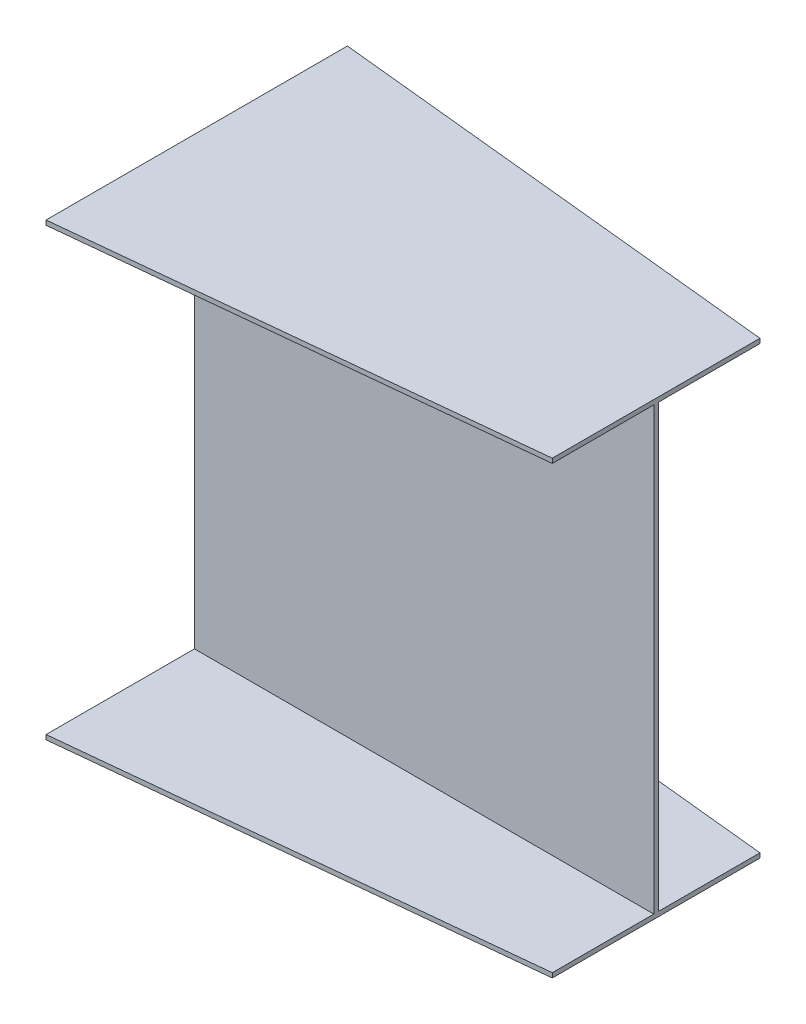
ISO-10303-21;
HEADER;
FILE_DESCRIPTION(('STEP AP214'),'2;1');
FILE_NAME('part.step','',(''),(''),'','','');
FILE_SCHEMA(('AUTOMOTIVE_DESIGN { 1 0 10303 214 1 1 1 1 }'));
ENDSEC;
DATA;
#1=APPLICATION_CONTEXT('core data for automotive mechanical design processes');
#2=APPLICATION_PROTOCOL_DEFINITION('international standard','automotive_design',2000,#1);
#3=PRODUCT_CONTEXT('',#1,'mechanical');
#4=PRODUCT('Part','Part','',(#3));
#5=PRODUCT_RELATED_PRODUCT_CATEGORY('part','',(#4));
#6=PRODUCT_DEFINITION_FORMATION('','',#4);
#7=PRODUCT_DEFINITION_CONTEXT('part definition',#1,'design');
#8=PRODUCT_DEFINITION('design','',#6,#7);
#9=PRODUCT_DEFINITION_SHAPE('','',#8);
#10=(LENGTH_UNIT() NAMED_UNIT(*) SI_UNIT(.MILLI.,.METRE.));
#11=(NAMED_UNIT(*) PLANE_ANGLE_UNIT() SI_UNIT($,.RADIAN.));
#12=(NAMED_UNIT(*) SI_UNIT($,.STERADIAN.) SOLID_ANGLE_UNIT());
#13=UNCERTAINTY_MEASURE_WITH_UNIT(LENGTH_MEASURE(1.E-05),#10,'distance_accuracy_value','');
#14=(GEOMETRIC_REPRESENTATION_CONTEXT(3) GLOBAL_UNCERTAINTY_ASSIGNED_CONTEXT((#13)) GLOBAL_UNIT_ASSIGNED_CONTEXT((#10,
#11,#12)) REPRESENTATION_CONTEXT('',''));
#15=CARTESIAN_POINT('',(0.,0.,0.));
#16=DIRECTION('',(0.,0.,1.));
#17=DIRECTION('',(1.,0.,0.));
#18=AXIS2_PLACEMENT_3D('',#15,#16,#17);
#19=CARTESIAN_POINT('',(1000.,0.,0.));
#20=DIRECTION('',(-1.,0.,0.));
#21=DIRECTION('',(0.,0.,1.));
#22=AXIS2_PLACEMENT_3D('',#19,#20,#21);
#23=PLANE('',#22);
#24=DIRECTION('',(0.,-1.,0.));
#25=VECTOR('',#24,1.);
#26=CARTESIAN_POINT('',(1000.,490.,-221.));
#27=LINE('',#26,#25);
#28=CARTESIAN_POINT('',(1000.,490.,-221.));
#29=VERTEX_POINT('',#28);
#30=CARTESIAN_POINT('',(1000.,480.,-221.));
#31=VERTEX_POINT('',#30);
#32=EDGE_CURVE('E377',#29,#31,#27,.T.);
#33=ORIENTED_EDGE('',*,*,#32,.F.);
#34=DIRECTION('',(0.,0.,-1.));
#35=VECTOR('',#34,1.);
#36=CARTESIAN_POINT('',(1000.,490.,-221.));
#37=LINE('',#36,#35);
#38=CARTESIAN_POINT('',(1000.,490.,231.));
#39=VERTEX_POINT('',#38);
#40=EDGE_CURVE('E12',#39,#29,#37,.T.);
#41=ORIENTED_EDGE('',*,*,#40,.F.);
#42=DIRECTION('',(0.,1.,0.));
#43=VECTOR('',#42,1.);
#44=CARTESIAN_POINT('',(1000.,490.,231.));
#45=LINE('',#44,#43);
#46=CARTESIAN_POINT('',(1000.,480.,231.));
#47=VERTEX_POINT('',#46);
#48=EDGE_CURVE('E71',#47,#39,#45,.T.);
#49=ORIENTED_EDGE('',*,*,#48,.F.);
#50=DIRECTION('',(0.,0.,1.));
#51=VECTOR('',#50,1.);
#52=CARTESIAN_POINT('',(1000.,480.,10.0000000000002));
#53=LINE('',#52,#51);
#54=CARTESIAN_POINT('',(1000.,480.,10.0000000000002));
#55=VERTEX_POINT('',#54);
#56=EDGE_CURVE('E652',#55,#47,#53,.T.);
#57=ORIENTED_EDGE('',*,*,#56,.F.);
#58=DIRECTION('',(0.,1.,0.));
#59=VECTOR('',#58,1.);
#60=CARTESIAN_POINT('',(1000.,480.,10.0000000000002));
#61=LINE('',#60,#59);
#62=CARTESIAN_POINT('',(1000.,-480.,10.0000000000002));
#63=VERTEX_POINT('',#62);
#64=EDGE_CURVE('E414',#63,#55,#61,.T.);
#65=ORIENTED_EDGE('',*,*,#64,.F.);
#66=DIRECTION('',(0.,0.,-1.));
#67=VECTOR('',#66,1.);
#68=CARTESIAN_POINT('',(1000.,-480.,10.0000000000002));
#69=LINE('',#68,#67);
#70=CARTESIAN_POINT('',(1000.,-480.,231.));
#71=VERTEX_POINT('',#70);
#72=EDGE_CURVE('E428',#71,#63,#69,.T.);
#73=ORIENTED_EDGE('',*,*,#72,.F.);
#74=DIRECTION('',(0.,1.,0.));
#75=VECTOR('',#74,1.);
#76=CARTESIAN_POINT('',(1000.,-480.,231.));
#77=LINE('',#76,#75);
#78=CARTESIAN_POINT('',(1000.,-490.,231.));
#79=VERTEX_POINT('',#78);
#80=EDGE_CURVE('E442',#79,#71,#77,.T.);
#81=ORIENTED_EDGE('',*,*,#80,.F.);
#82=DIRECTION('',(0.,0.,1.));
#83=VECTOR('',#82,1.);
#84=CARTESIAN_POINT('',(1000.,-490.,-221.));
#85=LINE('',#84,#83);
#86=CARTESIAN_POINT('',(1000.,-490.,-221.));
#87=VERTEX_POINT('',#86);
#88=EDGE_CURVE('E623',#87,#79,#85,.T.);
#89=ORIENTED_EDGE('',*,*,#88,.F.);
#90=DIRECTION('',(0.,-1.,0.));
#91=VECTOR('',#90,1.);
#92=CARTESIAN_POINT('',(1000.,-480.,-221.));
#93=LINE('',#92,#91);
#94=CARTESIAN_POINT('',(1000.,-480.,-221.));
#95=VERTEX_POINT('',#94);
#96=EDGE_CURVE('E615',#95,#87,#93,.T.);
#97=ORIENTED_EDGE('',*,*,#96,.F.);
#98=DIRECTION('',(0.,0.,-1.));
#99=VECTOR('',#98,1.);
#100=CARTESIAN_POINT('',(1000.,-480.,-221.));
#101=LINE('',#100,#99);
#102=CARTESIAN_POINT('',(1000.,-480.,2.22044604925031E-13));
#103=VERTEX_POINT('',#102);
#104=EDGE_CURVE('E530',#103,#95,#101,.T.);
#105=ORIENTED_EDGE('',*,*,#104,.F.);
#106=DIRECTION('',(0.,-1.,0.));
#107=VECTOR('',#106,1.);
#108=CARTESIAN_POINT('',(1000.,480.,2.22044604925031E-13));
#109=LINE('',#108,#107);
#110=CARTESIAN_POINT('',(1000.,480.,2.22044604925031E-13));
#111=VERTEX_POINT('',#110);
#112=EDGE_CURVE('E85',#111,#103,#109,.T.);
#113=ORIENTED_EDGE('',*,*,#112,.F.);
#114=DIRECTION('',(0.,0.,1.));
#115=VECTOR('',#114,1.);
#116=CARTESIAN_POINT('',(1000.,480.,-221.));
#117=LINE('',#116,#115);
#118=EDGE_CURVE('E79',#31,#111,#117,.T.);
#119=ORIENTED_EDGE('',*,*,#118,.F.);
#120=EDGE_LOOP('',(#33,#41,#49,#57,#65,#73,#81,#89,#97,#105,#113,#119));
#121=FACE_BOUND('',#120,.T.);
#122=ADVANCED_FACE('F61',(#121),#23,.F.);
#123=CARTESIAN_POINT('',(0.,0.,0.));
#124=DIRECTION('',(1.,0.,0.));
#125=DIRECTION('',(0.,0.,-1.));
#126=AXIS2_PLACEMENT_3D('',#123,#124,#125);
#127=PLANE('',#126);
#128=DIRECTION('',(0.,-1.,0.));
#129=VECTOR('',#128,1.);
#130=CARTESIAN_POINT('',(0.,490.,333.));
#131=LINE('',#130,#129);
#132=CARTESIAN_POINT('',(0.,490.,333.));
#133=VERTEX_POINT('',#132);
#134=CARTESIAN_POINT('',(0.,480.,333.));
#135=VERTEX_POINT('',#134);
#136=EDGE_CURVE('E160',#133,#135,#131,.T.);
#137=ORIENTED_EDGE('',*,*,#136,.F.);
#138=DIRECTION('',(0.,0.,1.));
#139=VECTOR('',#138,1.);
#140=CARTESIAN_POINT('',(0.,490.,333.));
#141=LINE('',#140,#139);
#142=CARTESIAN_POINT('',(0.,490.,-323.));
#143=VERTEX_POINT('',#142);
#144=EDGE_CURVE('E169',#143,#133,#141,.T.);
#145=ORIENTED_EDGE('',*,*,#144,.F.);
#146=DIRECTION('',(0.,1.,0.));
#147=VECTOR('',#146,1.);
#148=CARTESIAN_POINT('',(0.,490.,-323.));
#149=LINE('',#148,#147);
#150=CARTESIAN_POINT('',(0.,480.,-323.));
#151=VERTEX_POINT('',#150);
#152=EDGE_CURVE('E176',#151,#143,#149,.T.);
#153=ORIENTED_EDGE('',*,*,#152,.F.);
#154=DIRECTION('',(0.,0.,-1.));
#155=VECTOR('',#154,1.);
#156=CARTESIAN_POINT('',(0.,480.,4.50116022601054E-13));
#157=LINE('',#156,#155);
#158=CARTESIAN_POINT('',(0.,480.,4.50116022601054E-13));
#159=VERTEX_POINT('',#158);
#160=EDGE_CURVE('E300',#159,#151,#157,.T.);
#161=ORIENTED_EDGE('',*,*,#160,.F.);
#162=DIRECTION('',(0.,1.,0.));
#163=VECTOR('',#162,1.);
#164=CARTESIAN_POINT('',(0.,480.,4.50116022601054E-13));
#165=LINE('',#164,#163);
#166=CARTESIAN_POINT('',(0.,-480.,4.50116022601054E-13));
#167=VERTEX_POINT('',#166);
#168=EDGE_CURVE('E296',#167,#159,#165,.T.);
#169=ORIENTED_EDGE('',*,*,#168,.F.);
#170=DIRECTION('',(0.,0.,1.));
#171=VECTOR('',#170,1.);
#172=CARTESIAN_POINT('',(0.,-480.,4.50116022601054E-13));
#173=LINE('',#172,#171);
#174=CARTESIAN_POINT('',(0.,-480.,-323.));
#175=VERTEX_POINT('',#174);
#176=EDGE_CURVE('E292',#175,#167,#173,.T.);
#177=ORIENTED_EDGE('',*,*,#176,.F.);
#178=DIRECTION('',(0.,1.,0.));
#179=VECTOR('',#178,1.);
#180=CARTESIAN_POINT('',(0.,-480.,-323.));
#181=LINE('',#180,#179);
#182=CARTESIAN_POINT('',(0.,-490.,-323.));
#183=VERTEX_POINT('',#182);
#184=EDGE_CURVE('E288',#183,#175,#181,.T.);
#185=ORIENTED_EDGE('',*,*,#184,.F.);
#186=DIRECTION('',(0.,0.,-1.));
#187=VECTOR('',#186,1.);
#188=CARTESIAN_POINT('',(0.,-490.,333.));
#189=LINE('',#188,#187);
#190=CARTESIAN_POINT('',(0.,-490.,333.));
#191=VERTEX_POINT('',#190);
#192=EDGE_CURVE('E284',#191,#183,#189,.T.);
#193=ORIENTED_EDGE('',*,*,#192,.F.);
#194=DIRECTION('',(0.,-1.,0.));
#195=VECTOR('',#194,1.);
#196=CARTESIAN_POINT('',(0.,-480.,333.));
#197=LINE('',#196,#195);
#198=CARTESIAN_POINT('',(0.,-480.,333.));
#199=VERTEX_POINT('',#198);
#200=EDGE_CURVE('E280',#199,#191,#197,.T.);
#201=ORIENTED_EDGE('',*,*,#200,.F.);
#202=DIRECTION('',(0.,0.,1.));
#203=VECTOR('',#202,1.);
#204=CARTESIAN_POINT('',(0.,-480.,333.));
#205=LINE('',#204,#203);
#206=CARTESIAN_POINT('',(0.,-480.,10.0000000000005));
#207=VERTEX_POINT('',#206);
#208=EDGE_CURVE('E275',#207,#199,#205,.T.);
#209=ORIENTED_EDGE('',*,*,#208,.F.);
#210=DIRECTION('',(0.,-1.,0.));
#211=VECTOR('',#210,1.);
#212=CARTESIAN_POINT('',(0.,480.,10.0000000000005));
#213=LINE('',#212,#211);
#214=CARTESIAN_POINT('',(0.,480.,10.0000000000005));
#215=VERTEX_POINT('',#214);
#216=EDGE_CURVE('E273',#215,#207,#213,.T.);
#217=ORIENTED_EDGE('',*,*,#216,.F.);
#218=DIRECTION('',(0.,0.,-1.));
#219=VECTOR('',#218,1.);
#220=CARTESIAN_POINT('',(0.,480.,333.));
#221=LINE('',#220,#219);
#222=EDGE_CURVE('E182',#135,#215,#221,.T.);
#223=ORIENTED_EDGE('',*,*,#222,.F.);
#224=EDGE_LOOP('',(#137,#145,#153,#161,#169,#177,#185,#193,#201,#209,#217,#223));
#225=FACE_BOUND('',#224,.T.);
#226=ADVANCED_FACE('F180',(#225),#127,.F.);
#227=CARTESIAN_POINT('',(0.,0.,10.0000000000005));
#228=DIRECTION('',(0.,0.,1.));
#229=DIRECTION('',(1.,0.,0.));
#230=AXIS2_PLACEMENT_3D('',#227,#228,#229);
#231=PLANE('',#230);
#232=DIRECTION('',(1.,0.,0.));
#233=VECTOR('',#232,1.);
#234=CARTESIAN_POINT('',(0.,-480.,10.0000000000005));
#235=LINE('',#234,#233);
#236=EDGE_CURVE('E175',#207,#63,#235,.T.);
#237=ORIENTED_EDGE('',*,*,#236,.T.);
#238=ORIENTED_EDGE('',*,*,#64,.T.);
#239=DIRECTION('',(1.,0.,0.));
#240=VECTOR('',#239,1.);
#241=CARTESIAN_POINT('',(0.,480.,10.0000000000005));
#242=LINE('',#241,#240);
#243=EDGE_CURVE('E387',#215,#55,#242,.T.);
#244=ORIENTED_EDGE('',*,*,#243,.F.);
#245=ORIENTED_EDGE('',*,*,#216,.T.);
#246=EDGE_LOOP('',(#237,#238,#244,#245));
#247=FACE_BOUND('',#246,.T.);
#248=ADVANCED_FACE('F203',(#247),#231,.T.);
#249=CARTESIAN_POINT('',(0.,480.,0.));
#250=DIRECTION('',(0.,-1.,0.));
#251=DIRECTION('',(1.,0.,0.));
#252=AXIS2_PLACEMENT_3D('',#249,#250,#251);
#253=PLANE('',#252);
#254=ORIENTED_EDGE('',*,*,#243,.T.);
#255=ORIENTED_EDGE('',*,*,#56,.T.);
#256=DIRECTION('',(0.994838242454285,0.,-0.101473500730337));
#257=VECTOR('',#256,1.);
#258=CARTESIAN_POINT('',(0.,480.,333.));
#259=LINE('',#258,#257);
#260=EDGE_CURVE('E165',#135,#47,#259,.T.);
#261=ORIENTED_EDGE('',*,*,#260,.F.);
#262=ORIENTED_EDGE('',*,*,#222,.T.);
#263=EDGE_LOOP('',(#254,#255,#261,#262));
#264=FACE_BOUND('',#263,.T.);
#265=ADVANCED_FACE('F389',(#264),#253,.T.);
#266=CARTESIAN_POINT('',(0.,-480.,0.));
#267=DIRECTION('',(0.,1.,0.));
#268=DIRECTION('',(-1.,0.,0.));
#269=AXIS2_PLACEMENT_3D('',#266,#267,#268);
#270=PLANE('',#269);
#271=DIRECTION('',(0.994838242454285,0.,-0.101473500730337));
#272=VECTOR('',#271,1.);
#273=CARTESIAN_POINT('',(0.,-480.,333.));
#274=LINE('',#273,#272);
#275=EDGE_CURVE('E475',#199,#71,#274,.T.);
#276=ORIENTED_EDGE('',*,*,#275,.T.);
#277=ORIENTED_EDGE('',*,*,#72,.T.);
#278=ORIENTED_EDGE('',*,*,#236,.F.);
#279=ORIENTED_EDGE('',*,*,#208,.T.);
#280=EDGE_LOOP('',(#276,#277,#278,#279));
#281=FACE_BOUND('',#280,.T.);
#282=ADVANCED_FACE('F398',(#281),#270,.T.);
#283=CARTESIAN_POINT('',(33.6162564677099,0.,329.571141840294));
#284=DIRECTION('',(0.101473500730337,0.,0.994838242454285));
#285=DIRECTION('',(0.994838242454285,0.,-0.101473500730337));
#286=AXIS2_PLACEMENT_3D('',#283,#284,#285);
#287=PLANE('',#286);
#288=DIRECTION('',(0.994838242454285,0.,-0.101473500730337));
#289=VECTOR('',#288,1.);
#290=CARTESIAN_POINT('',(0.,-490.,333.));
#291=LINE('',#290,#289);
#292=EDGE_CURVE('E467',#191,#79,#291,.T.);
#293=ORIENTED_EDGE('',*,*,#292,.T.);
#294=ORIENTED_EDGE('',*,*,#80,.T.);
#295=ORIENTED_EDGE('',*,*,#275,.F.);
#296=ORIENTED_EDGE('',*,*,#200,.T.);
#297=EDGE_LOOP('',(#293,#294,#295,#296));
#298=FACE_BOUND('',#297,.T.);
#299=ADVANCED_FACE('F448',(#298),#287,.T.);
#300=CARTESIAN_POINT('',(-1.36002320516582E-13,-490.,0.));
#301=DIRECTION('',(0.,-1.,0.));
#302=DIRECTION('',(1.,0.,0.));
#303=AXIS2_PLACEMENT_3D('',#300,#301,#302);
#304=PLANE('',#303);
#305=DIRECTION('',(0.994838242454285,0.,0.101473500730337));
#306=VECTOR('',#305,1.);
#307=CARTESIAN_POINT('',(0.,-490.,-323.));
#308=LINE('',#307,#306);
#309=EDGE_CURVE('E474',#183,#87,#308,.T.);
#310=ORIENTED_EDGE('',*,*,#309,.T.);
#311=ORIENTED_EDGE('',*,*,#88,.T.);
#312=ORIENTED_EDGE('',*,*,#292,.F.);
#313=ORIENTED_EDGE('',*,*,#192,.T.);
#314=EDGE_LOOP('',(#310,#311,#312,#313));
#315=FACE_BOUND('',#314,.T.);
#316=ADVANCED_FACE('F457',(#315),#304,.T.);
#317=CARTESIAN_POINT('',(32.6067592764874,0.,-319.674110553798));
#318=DIRECTION('',(0.101473500730337,0.,-0.994838242454285));
#319=DIRECTION('',(-0.994838242454285,0.,-0.101473500730337));
#320=AXIS2_PLACEMENT_3D('',#317,#318,#319);
#321=PLANE('',#320);
#322=DIRECTION('',(0.994838242454285,0.,0.101473500730337));
#323=VECTOR('',#322,1.);
#324=CARTESIAN_POINT('',(0.,-480.,-323.));
#325=LINE('',#324,#323);
#326=EDGE_CURVE('E492',#175,#95,#325,.T.);
#327=ORIENTED_EDGE('',*,*,#326,.T.);
#328=ORIENTED_EDGE('',*,*,#96,.T.);
#329=ORIENTED_EDGE('',*,*,#309,.F.);
#330=ORIENTED_EDGE('',*,*,#184,.T.);
#331=EDGE_LOOP('',(#327,#328,#329,#330));
#332=FACE_BOUND('',#331,.T.);
#333=ADVANCED_FACE('F503',(#332),#321,.T.);
#334=CARTESIAN_POINT('',(0.,-480.,0.));
#335=DIRECTION('',(0.,1.,0.));
#336=DIRECTION('',(0.,0.,1.));
#337=AXIS2_PLACEMENT_3D('',#334,#335,#336);
#338=PLANE('',#337);
#339=DIRECTION('',(1.,0.,0.));
#340=VECTOR('',#339,1.);
#341=CARTESIAN_POINT('',(0.,-480.,4.50116022601054E-13));
#342=LINE('',#341,#340);
#343=EDGE_CURVE('E569',#167,#103,#342,.T.);
#344=ORIENTED_EDGE('',*,*,#343,.T.);
#345=ORIENTED_EDGE('',*,*,#104,.T.);
#346=ORIENTED_EDGE('',*,*,#326,.F.);
#347=ORIENTED_EDGE('',*,*,#176,.T.);
#348=EDGE_LOOP('',(#344,#345,#346,#347));
#349=FACE_BOUND('',#348,.T.);
#350=ADVANCED_FACE('F512',(#349),#338,.T.);
#351=CARTESIAN_POINT('',(0.,0.,4.50116022601054E-13));
#352=DIRECTION('',(0.,0.,-1.));
#353=DIRECTION('',(-1.,0.,0.));
#354=AXIS2_PLACEMENT_3D('',#351,#352,#353);
#355=PLANE('',#354);
#356=DIRECTION('',(1.,0.,0.));
#357=VECTOR('',#356,1.);
#358=CARTESIAN_POINT('',(0.,480.,4.50116022601054E-13));
#359=LINE('',#358,#357);
#360=EDGE_CURVE('E561',#159,#111,#359,.T.);
#361=ORIENTED_EDGE('',*,*,#360,.T.);
#362=ORIENTED_EDGE('',*,*,#112,.T.);
#363=ORIENTED_EDGE('',*,*,#343,.F.);
#364=ORIENTED_EDGE('',*,*,#168,.T.);
#365=EDGE_LOOP('',(#361,#362,#363,#364));
#366=FACE_BOUND('',#365,.T.);
#367=ADVANCED_FACE('F546',(#366),#355,.T.);
#368=CARTESIAN_POINT('',(1.33226762955019E-13,480.,0.));
#369=DIRECTION('',(0.,-1.,0.));
#370=DIRECTION('',(1.,0.,0.));
#371=AXIS2_PLACEMENT_3D('',#368,#369,#370);
#372=PLANE('',#371);
#373=DIRECTION('',(0.994838242454285,0.,0.101473500730337));
#374=VECTOR('',#373,1.);
#375=CARTESIAN_POINT('',(0.,480.,-323.));
#376=LINE('',#375,#374);
#377=EDGE_CURVE('E568',#151,#31,#376,.T.);
#378=ORIENTED_EDGE('',*,*,#377,.T.);
#379=ORIENTED_EDGE('',*,*,#118,.T.);
#380=ORIENTED_EDGE('',*,*,#360,.F.);
#381=ORIENTED_EDGE('',*,*,#160,.T.);
#382=EDGE_LOOP('',(#378,#379,#380,#381));
#383=FACE_BOUND('',#382,.T.);
#384=ADVANCED_FACE('F327',(#383),#372,.T.);
#385=CARTESIAN_POINT('',(32.6067592764873,0.,-319.674110553798));
#386=DIRECTION('',(0.101473500730337,0.,-0.994838242454285));
#387=DIRECTION('',(-0.994838242454285,0.,-0.101473500730337));
#388=AXIS2_PLACEMENT_3D('',#385,#386,#387);
#389=PLANE('',#388);
#390=DIRECTION('',(0.994838242454285,0.,0.101473500730337));
#391=VECTOR('',#390,1.);
#392=CARTESIAN_POINT('',(0.,490.,-323.));
#393=LINE('',#392,#391);
#394=EDGE_CURVE('E166',#143,#29,#393,.T.);
#395=ORIENTED_EDGE('',*,*,#394,.T.);
#396=ORIENTED_EDGE('',*,*,#32,.T.);
#397=ORIENTED_EDGE('',*,*,#377,.F.);
#398=ORIENTED_EDGE('',*,*,#152,.T.);
#399=EDGE_LOOP('',(#395,#396,#397,#398));
#400=FACE_BOUND('',#399,.T.);
#401=ADVANCED_FACE('F317',(#400),#389,.T.);
#402=CARTESIAN_POINT('',(0.,490.,0.));
#403=DIRECTION('',(0.,1.,0.));
#404=DIRECTION('',(0.,0.,1.));
#405=AXIS2_PLACEMENT_3D('',#402,#403,#404);
#406=PLANE('',#405);
#407=DIRECTION('',(0.994838242454285,0.,-0.101473500730337));
#408=VECTOR('',#407,1.);
#409=CARTESIAN_POINT('',(0.,490.,333.));
#410=LINE('',#409,#408);
#411=EDGE_CURVE('E155',#133,#39,#410,.T.);
#412=ORIENTED_EDGE('',*,*,#411,.T.);
#413=ORIENTED_EDGE('',*,*,#40,.T.);
#414=ORIENTED_EDGE('',*,*,#394,.F.);
#415=ORIENTED_EDGE('',*,*,#144,.T.);
#416=EDGE_LOOP('',(#412,#413,#414,#415));
#417=FACE_BOUND('',#416,.T.);
#418=ADVANCED_FACE('F171',(#417),#406,.T.);
#419=CARTESIAN_POINT('',(33.61625646771,0.,329.571141840294));
#420=DIRECTION('',(0.101473500730337,0.,0.994838242454285));
#421=DIRECTION('',(0.994838242454285,0.,-0.101473500730337));
#422=AXIS2_PLACEMENT_3D('',#419,#420,#421);
#423=PLANE('',#422);
#424=ORIENTED_EDGE('',*,*,#260,.T.);
#425=ORIENTED_EDGE('',*,*,#48,.T.);
#426=ORIENTED_EDGE('',*,*,#411,.F.);
#427=ORIENTED_EDGE('',*,*,#136,.T.);
#428=EDGE_LOOP('',(#424,#425,#426,#427));
#429=FACE_BOUND('',#428,.T.);
#430=ADVANCED_FACE('F158',(#429),#423,.T.);
#431=CLOSED_SHELL('',(#122,#226,#248,#265,#282,#299,#316,#333,#350,#367,#384,#401,#418,#430));
#432=MANIFOLD_SOLID_BREP('B2',#431);
#433=ADVANCED_BREP_SHAPE_REPRESENTATION('',(#18,#432),#14);
#434=SHAPE_DEFINITION_REPRESENTATION(#9,#433);
ENDSEC;
END-ISO-10303-21;
